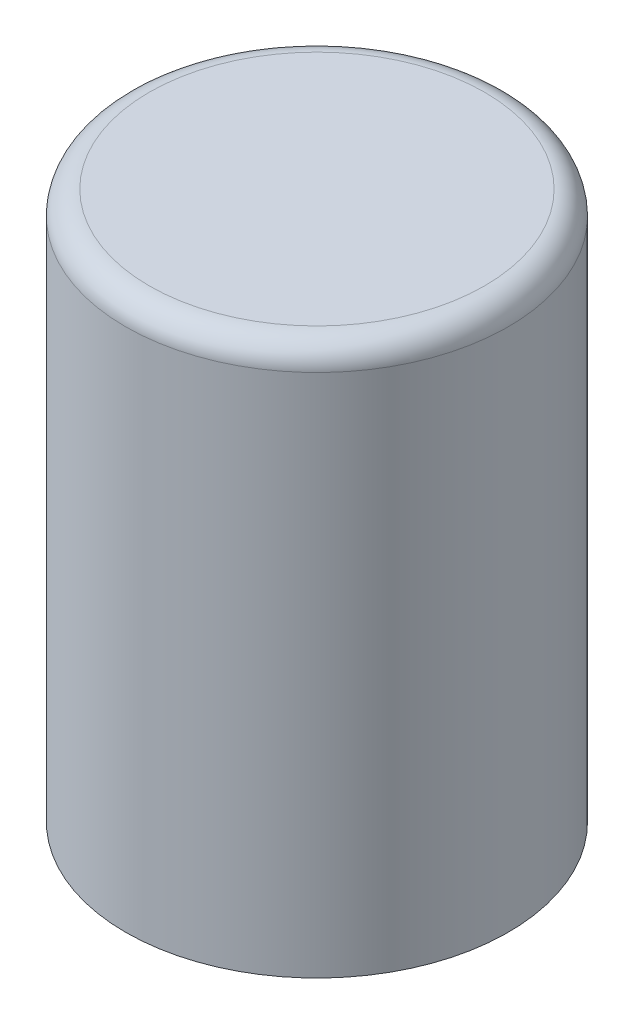
ISO-10303-21;
HEADER;
FILE_DESCRIPTION(('STEP AP214'),'2;1');
FILE_NAME('part.step','',(''),(''),'','','');
FILE_SCHEMA(('AUTOMOTIVE_DESIGN { 1 0 10303 214 1 1 1 1 }'));
ENDSEC;
DATA;
#1=APPLICATION_CONTEXT('core data for automotive mechanical design processes');
#2=APPLICATION_PROTOCOL_DEFINITION('international standard','automotive_design',2000,#1);
#3=PRODUCT_CONTEXT('',#1,'mechanical');
#4=PRODUCT('Part','Part','',(#3));
#5=PRODUCT_RELATED_PRODUCT_CATEGORY('part','',(#4));
#6=PRODUCT_DEFINITION_FORMATION('','',#4);
#7=PRODUCT_DEFINITION_CONTEXT('part definition',#1,'design');
#8=PRODUCT_DEFINITION('design','',#6,#7);
#9=PRODUCT_DEFINITION_SHAPE('','',#8);
#10=(LENGTH_UNIT() NAMED_UNIT(*) SI_UNIT(.MILLI.,.METRE.));
#11=(NAMED_UNIT(*) PLANE_ANGLE_UNIT() SI_UNIT($,.RADIAN.));
#12=(NAMED_UNIT(*) SI_UNIT($,.STERADIAN.) SOLID_ANGLE_UNIT());
#13=UNCERTAINTY_MEASURE_WITH_UNIT(LENGTH_MEASURE(1.E-05),#10,'distance_accuracy_value','');
#14=(GEOMETRIC_REPRESENTATION_CONTEXT(3) GLOBAL_UNCERTAINTY_ASSIGNED_CONTEXT((#13)) GLOBAL_UNIT_ASSIGNED_CONTEXT((#10,
#11,#12)) REPRESENTATION_CONTEXT('',''));
#15=CARTESIAN_POINT('',(0.,0.,0.));
#16=DIRECTION('',(0.,0.,1.));
#17=DIRECTION('',(1.,0.,0.));
#18=AXIS2_PLACEMENT_3D('',#15,#16,#17);
#19=CARTESIAN_POINT('',(-25.64532556392,15.547980609798,0.958911474964));
#20=DIRECTION('',(0.,1.,0.));
#21=DIRECTION('',(0.,0.,1.));
#22=AXIS2_PLACEMENT_3D('',#19,#20,#21);
#23=PLANE('',#22);
#24=CARTESIAN_POINT('',(-25.64532556392,15.547980609798,0.958911474964));
#25=DIRECTION('',(0.,-1.,0.));
#26=DIRECTION('',(0.,0.,-1.));
#27=AXIS2_PLACEMENT_3D('',#24,#25,#26);
#28=CIRCLE('',#27,3.55);
#29=CARTESIAN_POINT('',(-25.64532556392,15.547980609798,-2.591088525036));
#30=VERTEX_POINT('',#29);
#31=CARTESIAN_POINT('',(-25.64532556392,15.547980609798,4.508911474964));
#32=VERTEX_POINT('',#31);
#33=EDGE_CURVE('E40',#30,#32,#28,.T.);
#34=ORIENTED_EDGE('',*,*,#33,.F.);
#35=CARTESIAN_POINT('',(-25.64532556392,15.547980609798,0.958911474964));
#36=DIRECTION('',(0.,-1.,0.));
#37=DIRECTION('',(0.,0.,1.));
#38=AXIS2_PLACEMENT_3D('',#35,#36,#37);
#39=CIRCLE('',#38,3.55);
#40=EDGE_CURVE('E34',#32,#30,#39,.T.);
#41=ORIENTED_EDGE('',*,*,#40,.F.);
#42=EDGE_LOOP('',(#34,#41));
#43=FACE_BOUND('',#42,.T.);
#44=ADVANCED_FACE('F17',(#43),#23,.T.);
#45=CARTESIAN_POINT('',(-25.64532556392,15.047980609798,0.958911474964));
#46=DIRECTION('',(0.,1.,0.));
#47=DIRECTION('',(0.,0.,1.));
#48=AXIS2_PLACEMENT_3D('',#45,#46,#47);
#49=TOROIDAL_SURFACE('',#48,3.55,0.5);
#50=ORIENTED_EDGE('',*,*,#40,.T.);
#51=ORIENTED_EDGE('',*,*,#33,.T.);
#52=EDGE_LOOP('',(#50,#51));
#53=FACE_BOUND('',#52,.T.);
#54=CARTESIAN_POINT('',(-25.64532556392,15.047980609798,0.958911474964));
#55=DIRECTION('',(0.,1.,0.));
#56=DIRECTION('',(0.,0.,1.));
#57=AXIS2_PLACEMENT_3D('',#54,#55,#56);
#58=CIRCLE('',#57,4.05);
#59=CARTESIAN_POINT('',(-25.64532556392,15.047980609798,5.008911474964));
#60=VERTEX_POINT('',#59);
#61=EDGE_CURVE('E27',#60,#60,#58,.F.);
#62=ORIENTED_EDGE('',*,*,#61,.F.);
#63=EDGE_LOOP('',(#62));
#64=FACE_BOUND('',#63,.T.);
#65=ADVANCED_FACE('F38',(#53,#64),#49,.T.);
#66=CARTESIAN_POINT('',(-25.64532556392,3.947980609798,0.958911474964));
#67=DIRECTION('',(0.,1.,0.));
#68=DIRECTION('',(0.,0.,1.));
#69=AXIS2_PLACEMENT_3D('',#66,#67,#68);
#70=PLANE('',#69);
#71=CARTESIAN_POINT('',(-25.64532556392,3.947980609798,0.958911474964));
#72=DIRECTION('',(0.,1.,0.));
#73=DIRECTION('',(0.,0.,1.));
#74=AXIS2_PLACEMENT_3D('',#71,#72,#73);
#75=CIRCLE('',#74,4.05);
#76=CARTESIAN_POINT('',(-25.64532556392,3.947980609798,5.008911474964));
#77=VERTEX_POINT('',#76);
#78=EDGE_CURVE('E11',#77,#77,#75,.T.);
#79=ORIENTED_EDGE('',*,*,#78,.F.);
#80=EDGE_LOOP('',(#79));
#81=FACE_BOUND('',#80,.T.);
#82=ADVANCED_FACE('F73',(#81),#70,.F.);
#83=CARTESIAN_POINT('',(-25.64532556392,15.547980609798,0.958911474964));
#84=DIRECTION('',(0.,1.,0.));
#85=DIRECTION('',(0.,0.,1.));
#86=AXIS2_PLACEMENT_3D('',#83,#84,#85);
#87=CYLINDRICAL_SURFACE('',#86,4.05);
#88=ORIENTED_EDGE('',*,*,#78,.T.);
#89=EDGE_LOOP('',(#88));
#90=FACE_BOUND('',#89,.T.);
#91=ORIENTED_EDGE('',*,*,#61,.T.);
#92=EDGE_LOOP('',(#91));
#93=FACE_BOUND('',#92,.T.);
#94=ADVANCED_FACE('F77',(#90,#93),#87,.T.);
#95=CLOSED_SHELL('',(#44,#65,#82,#94));
#96=MANIFOLD_SOLID_BREP('B1',#95);
#97=ADVANCED_BREP_SHAPE_REPRESENTATION('',(#18,#96),#14);
#98=SHAPE_DEFINITION_REPRESENTATION(#9,#97);
ENDSEC;
END-ISO-10303-21;
